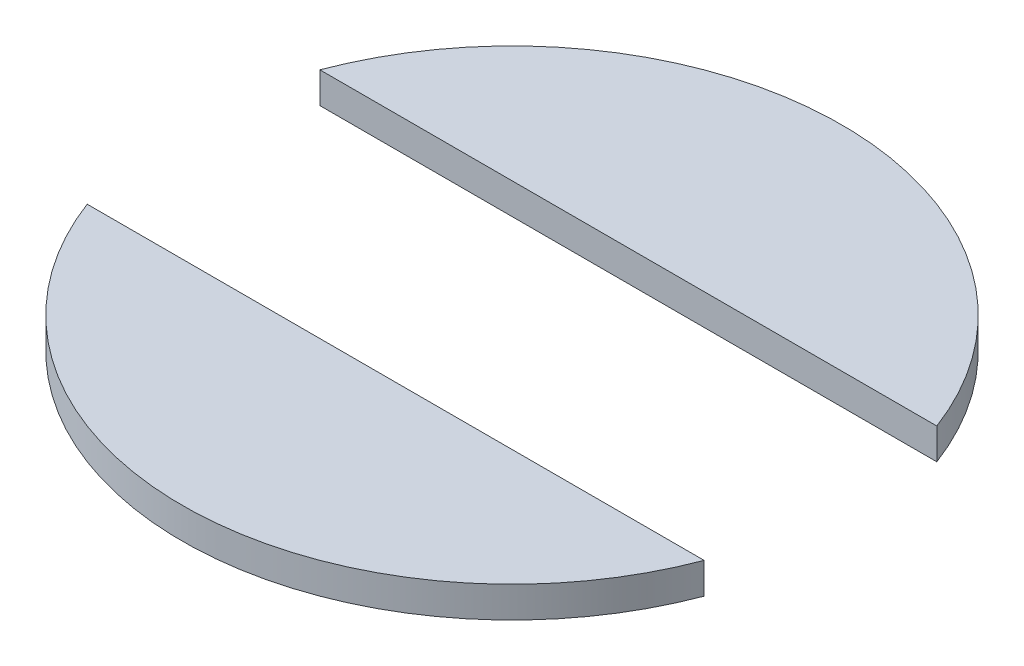
ISO-10303-21;
HEADER;
FILE_DESCRIPTION(('STEP AP214'),'2;1');
FILE_NAME('part.step','',(''),(''),'','','');
FILE_SCHEMA(('AUTOMOTIVE_DESIGN { 1 0 10303 214 1 1 1 1 }'));
ENDSEC;
DATA;
#1=APPLICATION_CONTEXT('core data for automotive mechanical design processes');
#2=APPLICATION_PROTOCOL_DEFINITION('international standard','automotive_design',2000,#1);
#3=PRODUCT_CONTEXT('',#1,'mechanical');
#4=PRODUCT('Part','Part','',(#3));
#5=PRODUCT_RELATED_PRODUCT_CATEGORY('part','',(#4));
#6=PRODUCT_DEFINITION_FORMATION('','',#4);
#7=PRODUCT_DEFINITION_CONTEXT('part definition',#1,'design');
#8=PRODUCT_DEFINITION('design','',#6,#7);
#9=PRODUCT_DEFINITION_SHAPE('','',#8);
#10=(LENGTH_UNIT() NAMED_UNIT(*) SI_UNIT(.MILLI.,.METRE.));
#11=(NAMED_UNIT(*) PLANE_ANGLE_UNIT() SI_UNIT($,.RADIAN.));
#12=(NAMED_UNIT(*) SI_UNIT($,.STERADIAN.) SOLID_ANGLE_UNIT());
#13=UNCERTAINTY_MEASURE_WITH_UNIT(LENGTH_MEASURE(1.E-05),#10,'distance_accuracy_value','');
#14=(GEOMETRIC_REPRESENTATION_CONTEXT(3) GLOBAL_UNCERTAINTY_ASSIGNED_CONTEXT((#13)) GLOBAL_UNIT_ASSIGNED_CONTEXT((#10,
#11,#12)) REPRESENTATION_CONTEXT('',''));
#15=CARTESIAN_POINT('',(0.,0.,0.));
#16=DIRECTION('',(0.,0.,1.));
#17=DIRECTION('',(1.,0.,0.));
#18=AXIS2_PLACEMENT_3D('',#15,#16,#17);
#19=CARTESIAN_POINT('',(0.,0.2,-0.75));
#20=DIRECTION('',(0.,0.,1.));
#21=DIRECTION('',(1.,0.,0.));
#22=AXIS2_PLACEMENT_3D('',#19,#20,#21);
#23=PLANE('',#22);
#24=DIRECTION('',(-1.,0.,0.));
#25=VECTOR('',#24,1.);
#26=CARTESIAN_POINT('',(0.,0.,-0.75));
#27=LINE('',#26,#25);
#28=CARTESIAN_POINT('',(1.98824671507336,0.,-0.75));
#29=VERTEX_POINT('',#28);
#30=CARTESIAN_POINT('',(-1.98824671507336,0.,-0.750000000000001));
#31=VERTEX_POINT('',#30);
#32=EDGE_CURVE('E81',#29,#31,#27,.T.);
#33=ORIENTED_EDGE('',*,*,#32,.F.);
#34=DIRECTION('',(0.,-1.,0.));
#35=VECTOR('',#34,1.);
#36=CARTESIAN_POINT('',(1.98824671507336,0.2,-0.75));
#37=LINE('',#36,#35);
#38=CARTESIAN_POINT('',(1.98824671507336,0.2,-0.75));
#39=VERTEX_POINT('',#38);
#40=EDGE_CURVE('E12',#39,#29,#37,.T.);
#41=ORIENTED_EDGE('',*,*,#40,.F.);
#42=DIRECTION('',(-1.,0.,0.));
#43=VECTOR('',#42,1.);
#44=CARTESIAN_POINT('',(0.,0.2,-0.75));
#45=LINE('',#44,#43);
#46=CARTESIAN_POINT('',(-1.98824671507336,0.2,-0.750000000000001));
#47=VERTEX_POINT('',#46);
#48=EDGE_CURVE('E82',#39,#47,#45,.T.);
#49=ORIENTED_EDGE('',*,*,#48,.T.);
#50=DIRECTION('',(0.,-1.,0.));
#51=VECTOR('',#50,1.);
#52=CARTESIAN_POINT('',(-1.98824671507336,0.2,-0.750000000000001));
#53=LINE('',#52,#51);
#54=EDGE_CURVE('E61',#47,#31,#53,.T.);
#55=ORIENTED_EDGE('',*,*,#54,.T.);
#56=EDGE_LOOP('',(#33,#41,#49,#55));
#57=FACE_BOUND('',#56,.T.);
#58=ADVANCED_FACE('F53',(#57),#23,.T.);
#59=CARTESIAN_POINT('',(0.,0.2,0.));
#60=DIRECTION('',(0.,-1.,0.));
#61=DIRECTION('',(0.,0.,-1.));
#62=AXIS2_PLACEMENT_3D('',#59,#60,#61);
#63=CYLINDRICAL_SURFACE('',#62,2.125);
#64=CARTESIAN_POINT('',(0.,0.,0.));
#65=DIRECTION('',(0.,1.,0.));
#66=DIRECTION('',(0.,0.,1.));
#67=AXIS2_PLACEMENT_3D('',#64,#65,#66);
#68=CIRCLE('',#67,2.125);
#69=EDGE_CURVE('E83',#29,#31,#68,.T.);
#70=ORIENTED_EDGE('',*,*,#69,.T.);
#71=ORIENTED_EDGE('',*,*,#54,.F.);
#72=CARTESIAN_POINT('',(0.,0.2,0.));
#73=DIRECTION('',(0.,1.,0.));
#74=DIRECTION('',(0.,0.,1.));
#75=AXIS2_PLACEMENT_3D('',#72,#73,#74);
#76=CIRCLE('',#75,2.125);
#77=EDGE_CURVE('E68',#39,#47,#76,.T.);
#78=ORIENTED_EDGE('',*,*,#77,.F.);
#79=ORIENTED_EDGE('',*,*,#40,.T.);
#80=EDGE_LOOP('',(#70,#71,#78,#79));
#81=FACE_BOUND('',#80,.T.);
#82=ADVANCED_FACE('F84',(#81),#63,.T.);
#83=CARTESIAN_POINT('',(0.,0.2,0.));
#84=DIRECTION('',(0.,1.,0.));
#85=DIRECTION('',(0.,0.,1.));
#86=AXIS2_PLACEMENT_3D('',#83,#84,#85);
#87=PLANE('',#86);
#88=ORIENTED_EDGE('',*,*,#48,.F.);
#89=ORIENTED_EDGE('',*,*,#77,.T.);
#90=EDGE_LOOP('',(#88,#89));
#91=FACE_BOUND('',#90,.T.);
#92=ADVANCED_FACE('F92',(#91),#87,.T.);
#93=CARTESIAN_POINT('',(0.,0.,0.));
#94=DIRECTION('',(0.,1.,0.));
#95=DIRECTION('',(0.,0.,1.));
#96=AXIS2_PLACEMENT_3D('',#93,#94,#95);
#97=PLANE('',#96);
#98=ORIENTED_EDGE('',*,*,#32,.T.);
#99=ORIENTED_EDGE('',*,*,#69,.F.);
#100=EDGE_LOOP('',(#98,#99));
#101=FACE_BOUND('',#100,.T.);
#102=ADVANCED_FACE('F87',(#101),#97,.F.);
#103=CLOSED_SHELL('',(#58,#82,#92,#102));
#104=MANIFOLD_SOLID_BREP('B2',#103);
#105=CARTESIAN_POINT('',(0.,0.2,0.75));
#106=DIRECTION('',(0.,0.,1.));
#107=DIRECTION('',(1.,0.,0.));
#108=AXIS2_PLACEMENT_3D('',#105,#106,#107);
#109=PLANE('',#108);
#110=DIRECTION('',(-1.,0.,0.));
#111=VECTOR('',#110,1.);
#112=CARTESIAN_POINT('',(0.,0.,0.75));
#113=LINE('',#112,#111);
#114=CARTESIAN_POINT('',(1.98824671507336,0.,0.75));
#115=VERTEX_POINT('',#114);
#116=CARTESIAN_POINT('',(-1.98824671507336,0.,0.750000000000001));
#117=VERTEX_POINT('',#116);
#118=EDGE_CURVE('E166',#115,#117,#113,.T.);
#119=ORIENTED_EDGE('',*,*,#118,.T.);
#120=DIRECTION('',(0.,-1.,0.));
#121=VECTOR('',#120,1.);
#122=CARTESIAN_POINT('',(-1.98824671507336,0.2,0.750000000000001));
#123=LINE('',#122,#121);
#124=CARTESIAN_POINT('',(-1.98824671507336,0.2,0.750000000000001));
#125=VERTEX_POINT('',#124);
#126=EDGE_CURVE('E51',#125,#117,#123,.T.);
#127=ORIENTED_EDGE('',*,*,#126,.F.);
#128=DIRECTION('',(-1.,0.,0.));
#129=VECTOR('',#128,1.);
#130=CARTESIAN_POINT('',(0.,0.2,0.75));
#131=LINE('',#130,#129);
#132=CARTESIAN_POINT('',(1.98824671507336,0.2,0.75));
#133=VERTEX_POINT('',#132);
#134=EDGE_CURVE('E165',#133,#125,#131,.T.);
#135=ORIENTED_EDGE('',*,*,#134,.F.);
#136=DIRECTION('',(0.,-1.,0.));
#137=VECTOR('',#136,1.);
#138=CARTESIAN_POINT('',(1.98824671507336,0.2,0.75));
#139=LINE('',#138,#137);
#140=EDGE_CURVE('E142',#133,#115,#139,.T.);
#141=ORIENTED_EDGE('',*,*,#140,.T.);
#142=EDGE_LOOP('',(#119,#127,#135,#141));
#143=FACE_BOUND('',#142,.T.);
#144=ADVANCED_FACE('F133',(#143),#109,.F.);
#145=CARTESIAN_POINT('',(0.,0.2,0.));
#146=DIRECTION('',(0.,-1.,0.));
#147=DIRECTION('',(0.,0.,-1.));
#148=AXIS2_PLACEMENT_3D('',#145,#146,#147);
#149=CYLINDRICAL_SURFACE('',#148,2.125);
#150=CARTESIAN_POINT('',(0.,0.,0.));
#151=DIRECTION('',(0.,1.,0.));
#152=DIRECTION('',(0.,0.,1.));
#153=AXIS2_PLACEMENT_3D('',#150,#151,#152);
#154=CIRCLE('',#153,2.125);
#155=EDGE_CURVE('E157',#117,#115,#154,.T.);
#156=ORIENTED_EDGE('',*,*,#155,.T.);
#157=ORIENTED_EDGE('',*,*,#140,.F.);
#158=CARTESIAN_POINT('',(0.,0.2,0.));
#159=DIRECTION('',(0.,1.,0.));
#160=DIRECTION('',(0.,0.,1.));
#161=AXIS2_PLACEMENT_3D('',#158,#159,#160);
#162=CIRCLE('',#161,2.125);
#163=EDGE_CURVE('E149',#125,#133,#162,.T.);
#164=ORIENTED_EDGE('',*,*,#163,.F.);
#165=ORIENTED_EDGE('',*,*,#126,.T.);
#166=EDGE_LOOP('',(#156,#157,#164,#165));
#167=FACE_BOUND('',#166,.T.);
#168=ADVANCED_FACE('F160',(#167),#149,.T.);
#169=CARTESIAN_POINT('',(0.,0.2,0.));
#170=DIRECTION('',(0.,1.,0.));
#171=DIRECTION('',(0.,0.,1.));
#172=AXIS2_PLACEMENT_3D('',#169,#170,#171);
#173=PLANE('',#172);
#174=ORIENTED_EDGE('',*,*,#134,.T.);
#175=ORIENTED_EDGE('',*,*,#163,.T.);
#176=EDGE_LOOP('',(#174,#175));
#177=FACE_BOUND('',#176,.T.);
#178=ADVANCED_FACE('F177',(#177),#173,.T.);
#179=CARTESIAN_POINT('',(0.,0.,0.));
#180=DIRECTION('',(0.,1.,0.));
#181=DIRECTION('',(0.,0.,1.));
#182=AXIS2_PLACEMENT_3D('',#179,#180,#181);
#183=PLANE('',#182);
#184=ORIENTED_EDGE('',*,*,#118,.F.);
#185=ORIENTED_EDGE('',*,*,#155,.F.);
#186=EDGE_LOOP('',(#184,#185));
#187=FACE_BOUND('',#186,.T.);
#188=ADVANCED_FACE('F170',(#187),#183,.F.);
#189=CLOSED_SHELL('',(#144,#168,#178,#188));
#190=MANIFOLD_SOLID_BREP('B6',#189);
#191=ADVANCED_BREP_SHAPE_REPRESENTATION('',(#18,#104,#190),#14);
#192=SHAPE_DEFINITION_REPRESENTATION(#9,#191);
ENDSEC;
END-ISO-10303-21;
